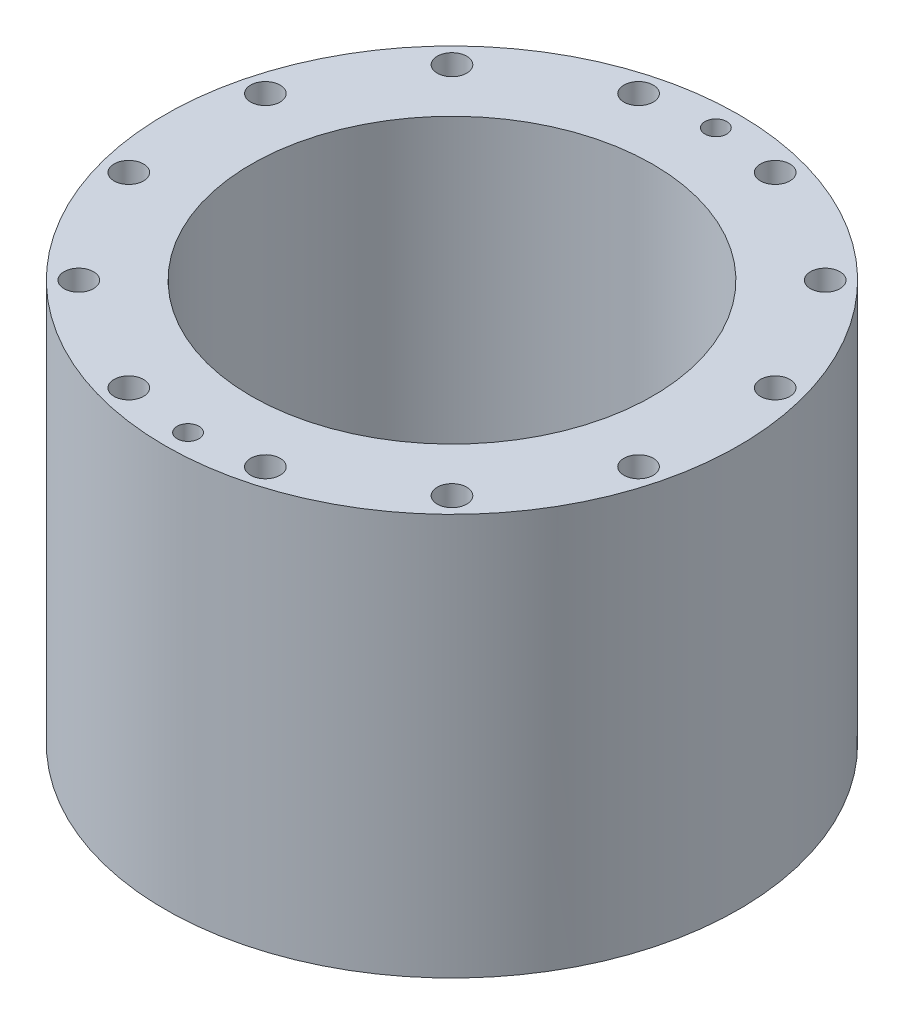
ISO-10303-21;
HEADER;
FILE_DESCRIPTION(('STEP AP214'),'2;1');
FILE_NAME('part.step','',(''),(''),'','','');
FILE_SCHEMA(('AUTOMOTIVE_DESIGN { 1 0 10303 214 1 1 1 1 }'));
ENDSEC;
DATA;
#1=APPLICATION_CONTEXT('core data for automotive mechanical design processes');
#2=APPLICATION_PROTOCOL_DEFINITION('international standard','automotive_design',2000,#1);
#3=PRODUCT_CONTEXT('',#1,'mechanical');
#4=PRODUCT('Part','Part','',(#3));
#5=PRODUCT_RELATED_PRODUCT_CATEGORY('part','',(#4));
#6=PRODUCT_DEFINITION_FORMATION('','',#4);
#7=PRODUCT_DEFINITION_CONTEXT('part definition',#1,'design');
#8=PRODUCT_DEFINITION('design','',#6,#7);
#9=PRODUCT_DEFINITION_SHAPE('','',#8);
#10=(LENGTH_UNIT() NAMED_UNIT(*) SI_UNIT(.MILLI.,.METRE.));
#11=(NAMED_UNIT(*) PLANE_ANGLE_UNIT() SI_UNIT($,.RADIAN.));
#12=(NAMED_UNIT(*) SI_UNIT($,.STERADIAN.) SOLID_ANGLE_UNIT());
#13=UNCERTAINTY_MEASURE_WITH_UNIT(LENGTH_MEASURE(1.E-05),#10,'distance_accuracy_value','');
#14=(GEOMETRIC_REPRESENTATION_CONTEXT(3) GLOBAL_UNCERTAINTY_ASSIGNED_CONTEXT((#13)) GLOBAL_UNIT_ASSIGNED_CONTEXT((#10,
#11,#12)) REPRESENTATION_CONTEXT('',''));
#15=CARTESIAN_POINT('',(0.,0.,0.));
#16=DIRECTION('',(0.,0.,1.));
#17=DIRECTION('',(1.,0.,0.));
#18=AXIS2_PLACEMENT_3D('',#15,#16,#17);
#19=CARTESIAN_POINT('',(0.,0.,0.));
#20=DIRECTION('',(0.,1.,0.));
#21=DIRECTION('',(0.,0.,1.));
#22=AXIS2_PLACEMENT_3D('',#19,#20,#21);
#23=PLANE('',#22);
#24=CARTESIAN_POINT('',(0.,0.,0.));
#25=DIRECTION('',(0.,1.,0.));
#26=DIRECTION('',(0.,0.,1.));
#27=AXIS2_PLACEMENT_3D('',#24,#25,#26);
#28=CIRCLE('',#27,44.45);
#29=CARTESIAN_POINT('',(0.,0.,44.45));
#30=VERTEX_POINT('',#29);
#31=EDGE_CURVE('E42',#30,#30,#28,.T.);
#32=ORIENTED_EDGE('',*,*,#31,.T.);
#33=EDGE_LOOP('',(#32));
#34=FACE_BOUND('',#33,.T.);
#35=CARTESIAN_POINT('',(0.,0.,0.));
#36=DIRECTION('',(0.,-1.,0.));
#37=DIRECTION('',(0.,0.,-1.));
#38=AXIS2_PLACEMENT_3D('',#35,#36,#37);
#39=CIRCLE('',#38,47.4218);
#40=CARTESIAN_POINT('',(0.,0.,-47.4218));
#41=VERTEX_POINT('',#40);
#42=EDGE_CURVE('E69',#41,#41,#39,.T.);
#43=ORIENTED_EDGE('',*,*,#42,.T.);
#44=EDGE_LOOP('',(#43));
#45=FACE_BOUND('',#44,.T.);
#46=ADVANCED_FACE('F38',(#34,#45),#23,.F.);
#47=CARTESIAN_POINT('',(0.,88.9,0.));
#48=DIRECTION('',(0.,1.,0.));
#49=DIRECTION('',(0.,0.,1.));
#50=AXIS2_PLACEMENT_3D('',#47,#48,#49);
#51=PLANE('',#50);
#52=CARTESIAN_POINT('',(0.,88.9,-58.4200000000042));
#53=DIRECTION('',(0.,1.,0.));
#54=DIRECTION('',(0.,0.,1.));
#55=AXIS2_PLACEMENT_3D('',#52,#53,#54);
#56=CIRCLE('',#55,2.413);
#57=CARTESIAN_POINT('',(0.,88.9,-56.0070000000042));
#58=VERTEX_POINT('',#57);
#59=EDGE_CURVE('E181',#58,#58,#56,.T.);
#60=ORIENTED_EDGE('',*,*,#59,.F.);
#61=EDGE_LOOP('',(#60));
#62=FACE_BOUND('',#61,.T.);
#63=CARTESIAN_POINT('',(0.,88.9,58.4200000000042));
#64=DIRECTION('',(0.,1.,0.));
#65=DIRECTION('',(0.,0.,1.));
#66=AXIS2_PLACEMENT_3D('',#63,#64,#65);
#67=CIRCLE('',#66,2.413);
#68=CARTESIAN_POINT('',(0.,88.9,60.8330000000042));
#69=VERTEX_POINT('',#68);
#70=EDGE_CURVE('E173',#69,#69,#67,.T.);
#71=ORIENTED_EDGE('',*,*,#70,.F.);
#72=EDGE_LOOP('',(#71));
#73=FACE_BOUND('',#72,.T.);
#74=CARTESIAN_POINT('',(41.30917815692,88.9,41.309178156922));
#75=DIRECTION('',(0.,-1.,0.));
#76=DIRECTION('',(0.,0.,-1.));
#77=AXIS2_PLACEMENT_3D('',#74,#75,#76);
#78=CIRCLE('',#77,3.2639);
#79=CARTESIAN_POINT('',(41.30917815692,88.9,38.045278156922));
#80=VERTEX_POINT('',#79);
#81=EDGE_CURVE('E81',#80,#80,#78,.T.);
#82=ORIENTED_EDGE('',*,*,#81,.T.);
#83=EDGE_LOOP('',(#82));
#84=FACE_BOUND('',#83,.T.);
#85=CARTESIAN_POINT('',(56.4293867718131,88.9,15.1202086148954));
#86=DIRECTION('',(0.,-1.,0.));
#87=DIRECTION('',(0.,0.,-1.));
#88=AXIS2_PLACEMENT_3D('',#85,#86,#87);
#89=CIRCLE('',#88,3.2639);
#90=CARTESIAN_POINT('',(56.4293867718131,88.9,11.8563086148954));
#91=VERTEX_POINT('',#90);
#92=EDGE_CURVE('E138',#91,#91,#89,.T.);
#93=ORIENTED_EDGE('',*,*,#92,.T.);
#94=EDGE_LOOP('',(#93));
#95=FACE_BOUND('',#94,.T.);
#96=CARTESIAN_POINT('',(56.4293867718176,88.9,-15.1202086148831));
#97=DIRECTION('',(0.,-1.,0.));
#98=DIRECTION('',(0.,0.,-1.));
#99=AXIS2_PLACEMENT_3D('',#96,#97,#98);
#100=CIRCLE('',#99,3.2639);
#101=CARTESIAN_POINT('',(56.4293867718176,88.9,-18.3841086148831));
#102=VERTEX_POINT('',#101);
#103=EDGE_CURVE('E130',#102,#102,#100,.T.);
#104=ORIENTED_EDGE('',*,*,#103,.T.);
#105=EDGE_LOOP('',(#104));
#106=FACE_BOUND('',#105,.T.);
#107=CARTESIAN_POINT('',(41.3091781569322,88.9,-41.3091781569142));
#108=DIRECTION('',(0.,-1.,0.));
#109=DIRECTION('',(0.,0.,-1.));
#110=AXIS2_PLACEMENT_3D('',#107,#108,#109);
#111=CIRCLE('',#110,3.2639);
#112=CARTESIAN_POINT('',(41.3091781569322,88.9,-44.5730781569142));
#113=VERTEX_POINT('',#112);
#114=EDGE_CURVE('E122',#113,#113,#111,.T.);
#115=ORIENTED_EDGE('',*,*,#114,.T.);
#116=EDGE_LOOP('',(#115));
#117=FACE_BOUND('',#116,.T.);
#118=CARTESIAN_POINT('',(15.1202086149056,88.9,-56.4293867718074));
#119=DIRECTION('',(0.,-1.,0.));
#120=DIRECTION('',(0.,0.,-1.));
#121=AXIS2_PLACEMENT_3D('',#118,#119,#120);
#122=CIRCLE('',#121,3.2639);
#123=CARTESIAN_POINT('',(15.1202086149056,88.9,-59.6932867718074));
#124=VERTEX_POINT('',#123);
#125=EDGE_CURVE('E114',#124,#124,#122,.T.);
#126=ORIENTED_EDGE('',*,*,#125,.T.);
#127=EDGE_LOOP('',(#126));
#128=FACE_BOUND('',#127,.T.);
#129=CARTESIAN_POINT('',(-15.120208614873,88.9,-56.4293867718118));
#130=DIRECTION('',(0.,-1.,0.));
#131=DIRECTION('',(0.,0.,-1.));
#132=AXIS2_PLACEMENT_3D('',#129,#130,#131);
#133=CIRCLE('',#132,3.2639);
#134=CARTESIAN_POINT('',(-15.120208614873,88.9,-59.6932867718118));
#135=VERTEX_POINT('',#134);
#136=EDGE_CURVE('E106',#135,#135,#133,.T.);
#137=ORIENTED_EDGE('',*,*,#136,.T.);
#138=EDGE_LOOP('',(#137));
#139=FACE_BOUND('',#138,.T.);
#140=CARTESIAN_POINT('',(-41.3091781569041,88.9,-41.3091781569264));
#141=DIRECTION('',(0.,-1.,0.));
#142=DIRECTION('',(0.,0.,-1.));
#143=AXIS2_PLACEMENT_3D('',#140,#141,#142);
#144=CIRCLE('',#143,3.2639);
#145=CARTESIAN_POINT('',(-41.3091781569041,88.9,-44.5730781569264));
#146=VERTEX_POINT('',#145);
#147=EDGE_CURVE('E98',#146,#146,#144,.T.);
#148=ORIENTED_EDGE('',*,*,#147,.T.);
#149=EDGE_LOOP('',(#148));
#150=FACE_BOUND('',#149,.T.);
#151=CARTESIAN_POINT('',(-56.4293867717972,88.9,-15.1202086148998));
#152=DIRECTION('',(0.,-1.,0.));
#153=DIRECTION('',(0.,0.,-1.));
#154=AXIS2_PLACEMENT_3D('',#151,#152,#153);
#155=CIRCLE('',#154,3.2639);
#156=CARTESIAN_POINT('',(-56.4293867717972,88.9,-18.3841086148998));
#157=VERTEX_POINT('',#156);
#158=EDGE_CURVE('E89',#157,#157,#155,.T.);
#159=ORIENTED_EDGE('',*,*,#158,.T.);
#160=EDGE_LOOP('',(#159));
#161=FACE_BOUND('',#160,.T.);
#162=CARTESIAN_POINT('',(-56.4293867718017,88.9,15.1202086148788));
#163=DIRECTION('',(0.,-1.,0.));
#164=DIRECTION('',(0.,0.,-1.));
#165=AXIS2_PLACEMENT_3D('',#162,#163,#164);
#166=CIRCLE('',#165,3.2639);
#167=CARTESIAN_POINT('',(-56.4293867718017,88.9,11.8563086148788));
#168=VERTEX_POINT('',#167);
#169=EDGE_CURVE('E90',#168,#168,#166,.T.);
#170=ORIENTED_EDGE('',*,*,#169,.T.);
#171=EDGE_LOOP('',(#170));
#172=FACE_BOUND('',#171,.T.);
#173=CARTESIAN_POINT('',(-41.3091781569163,88.9,41.3091781569098));
#174=DIRECTION('',(0.,-1.,0.));
#175=DIRECTION('',(0.,0.,-1.));
#176=AXIS2_PLACEMENT_3D('',#173,#174,#175);
#177=CIRCLE('',#176,3.2639);
#178=CARTESIAN_POINT('',(-41.3091781569163,88.9,38.0452781569098));
#179=VERTEX_POINT('',#178);
#180=EDGE_CURVE('E162',#179,#179,#177,.T.);
#181=ORIENTED_EDGE('',*,*,#180,.T.);
#182=EDGE_LOOP('',(#181));
#183=FACE_BOUND('',#182,.T.);
#184=CARTESIAN_POINT('',(-15.1202086148897,88.9,56.429386771803));
#185=DIRECTION('',(0.,-1.,0.));
#186=DIRECTION('',(0.,0.,-1.));
#187=AXIS2_PLACEMENT_3D('',#184,#185,#186);
#188=CIRCLE('',#187,3.2639);
#189=CARTESIAN_POINT('',(-15.1202086148897,88.9,53.165486771803));
#190=VERTEX_POINT('',#189);
#191=EDGE_CURVE('E153',#190,#190,#188,.T.);
#192=ORIENTED_EDGE('',*,*,#191,.T.);
#193=EDGE_LOOP('',(#192));
#194=FACE_BOUND('',#193,.T.);
#195=CARTESIAN_POINT('',(15.1202086148889,88.9,56.4293867718075));
#196=DIRECTION('',(0.,-1.,0.));
#197=DIRECTION('',(0.,0.,-1.));
#198=AXIS2_PLACEMENT_3D('',#195,#196,#197);
#199=CIRCLE('',#198,3.2639);
#200=CARTESIAN_POINT('',(15.1202086148889,88.9,53.1654867718075));
#201=VERTEX_POINT('',#200);
#202=EDGE_CURVE('E73',#201,#201,#199,.T.);
#203=ORIENTED_EDGE('',*,*,#202,.T.);
#204=EDGE_LOOP('',(#203));
#205=FACE_BOUND('',#204,.T.);
#206=CARTESIAN_POINT('',(0.,88.9,0.));
#207=DIRECTION('',(0.,1.,0.));
#208=DIRECTION('',(0.,0.,1.));
#209=AXIS2_PLACEMENT_3D('',#206,#207,#208);
#210=CIRCLE('',#209,44.45);
#211=CARTESIAN_POINT('',(0.,88.9,44.45));
#212=VERTEX_POINT('',#211);
#213=EDGE_CURVE('E10',#212,#212,#210,.T.);
#214=ORIENTED_EDGE('',*,*,#213,.F.);
#215=EDGE_LOOP('',(#214));
#216=FACE_BOUND('',#215,.T.);
#217=CARTESIAN_POINT('',(0.,88.9,0.));
#218=DIRECTION('',(0.,1.,0.));
#219=DIRECTION('',(0.,0.,1.));
#220=AXIS2_PLACEMENT_3D('',#217,#218,#219);
#221=CIRCLE('',#220,63.5);
#222=CARTESIAN_POINT('',(0.,88.9,63.5));
#223=VERTEX_POINT('',#222);
#224=EDGE_CURVE('E53',#223,#223,#221,.F.);
#225=ORIENTED_EDGE('',*,*,#224,.F.);
#226=EDGE_LOOP('',(#225));
#227=FACE_BOUND('',#226,.T.);
#228=ADVANCED_FACE('F198',(#62,#73,#84,#95,#106,#117,#128,#139,#150,#161,#172,#183,#194,#205,
#216,#227),#51,.T.);
#229=CARTESIAN_POINT('',(41.30917815692,0.,41.309178156922));
#230=DIRECTION('',(0.,-1.,0.));
#231=DIRECTION('',(0.,0.,-1.));
#232=AXIS2_PLACEMENT_3D('',#229,#230,#231);
#233=CIRCLE('',#232,3.2639);
#234=CARTESIAN_POINT('',(41.30917815692,0.,38.045278156922));
#235=VERTEX_POINT('',#234);
#236=EDGE_CURVE('E142',#235,#235,#233,.T.);
#237=ORIENTED_EDGE('',*,*,#236,.F.);
#238=EDGE_LOOP('',(#237));
#239=FACE_BOUND('',#238,.T.);
#240=CARTESIAN_POINT('',(56.4293867718131,0.,15.1202086148954));
#241=DIRECTION('',(0.,-1.,0.));
#242=DIRECTION('',(0.,0.,-1.));
#243=AXIS2_PLACEMENT_3D('',#240,#241,#242);
#244=CIRCLE('',#243,3.2639);
#245=CARTESIAN_POINT('',(56.4293867718131,0.,11.8563086148954));
#246=VERTEX_POINT('',#245);
#247=EDGE_CURVE('E134',#246,#246,#244,.T.);
#248=ORIENTED_EDGE('',*,*,#247,.F.);
#249=EDGE_LOOP('',(#248));
#250=FACE_BOUND('',#249,.T.);
#251=CARTESIAN_POINT('',(56.4293867718176,0.,-15.1202086148831));
#252=DIRECTION('',(0.,-1.,0.));
#253=DIRECTION('',(0.,0.,-1.));
#254=AXIS2_PLACEMENT_3D('',#251,#252,#253);
#255=CIRCLE('',#254,3.2639);
#256=CARTESIAN_POINT('',(56.4293867718176,0.,-18.3841086148831));
#257=VERTEX_POINT('',#256);
#258=EDGE_CURVE('E126',#257,#257,#255,.T.);
#259=ORIENTED_EDGE('',*,*,#258,.F.);
#260=EDGE_LOOP('',(#259));
#261=FACE_BOUND('',#260,.T.);
#262=CARTESIAN_POINT('',(41.3091781569322,0.,-41.3091781569142));
#263=DIRECTION('',(0.,-1.,0.));
#264=DIRECTION('',(0.,0.,-1.));
#265=AXIS2_PLACEMENT_3D('',#262,#263,#264);
#266=CIRCLE('',#265,3.2639);
#267=CARTESIAN_POINT('',(41.3091781569322,0.,-44.5730781569142));
#268=VERTEX_POINT('',#267);
#269=EDGE_CURVE('E118',#268,#268,#266,.T.);
#270=ORIENTED_EDGE('',*,*,#269,.F.);
#271=EDGE_LOOP('',(#270));
#272=FACE_BOUND('',#271,.T.);
#273=CARTESIAN_POINT('',(15.1202086149056,0.,-56.4293867718074));
#274=DIRECTION('',(0.,-1.,0.));
#275=DIRECTION('',(0.,0.,-1.));
#276=AXIS2_PLACEMENT_3D('',#273,#274,#275);
#277=CIRCLE('',#276,3.2639);
#278=CARTESIAN_POINT('',(15.1202086149056,0.,-59.6932867718074));
#279=VERTEX_POINT('',#278);
#280=EDGE_CURVE('E110',#279,#279,#277,.T.);
#281=ORIENTED_EDGE('',*,*,#280,.F.);
#282=EDGE_LOOP('',(#281));
#283=FACE_BOUND('',#282,.T.);
#284=CARTESIAN_POINT('',(-15.120208614873,0.,-56.4293867718118));
#285=DIRECTION('',(0.,-1.,0.));
#286=DIRECTION('',(0.,0.,-1.));
#287=AXIS2_PLACEMENT_3D('',#284,#285,#286);
#288=CIRCLE('',#287,3.2639);
#289=CARTESIAN_POINT('',(-15.120208614873,0.,-59.6932867718118));
#290=VERTEX_POINT('',#289);
#291=EDGE_CURVE('E102',#290,#290,#288,.T.);
#292=ORIENTED_EDGE('',*,*,#291,.F.);
#293=EDGE_LOOP('',(#292));
#294=FACE_BOUND('',#293,.T.);
#295=CARTESIAN_POINT('',(-41.3091781569041,0.,-41.3091781569264));
#296=DIRECTION('',(0.,-1.,0.));
#297=DIRECTION('',(0.,0.,-1.));
#298=AXIS2_PLACEMENT_3D('',#295,#296,#297);
#299=CIRCLE('',#298,3.2639);
#300=CARTESIAN_POINT('',(-41.3091781569041,0.,-44.5730781569264));
#301=VERTEX_POINT('',#300);
#302=EDGE_CURVE('E94',#301,#301,#299,.T.);
#303=ORIENTED_EDGE('',*,*,#302,.F.);
#304=EDGE_LOOP('',(#303));
#305=FACE_BOUND('',#304,.T.);
#306=CARTESIAN_POINT('',(-56.4293867717972,0.,-15.1202086148998));
#307=DIRECTION('',(0.,-1.,0.));
#308=DIRECTION('',(0.,0.,-1.));
#309=AXIS2_PLACEMENT_3D('',#306,#307,#308);
#310=CIRCLE('',#309,3.2639);
#311=CARTESIAN_POINT('',(-56.4293867717972,0.,-18.3841086148998));
#312=VERTEX_POINT('',#311);
#313=EDGE_CURVE('E85',#312,#312,#310,.T.);
#314=ORIENTED_EDGE('',*,*,#313,.F.);
#315=EDGE_LOOP('',(#314));
#316=FACE_BOUND('',#315,.T.);
#317=CARTESIAN_POINT('',(-56.4293867718017,0.,15.1202086148788));
#318=DIRECTION('',(0.,-1.,0.));
#319=DIRECTION('',(0.,0.,-1.));
#320=AXIS2_PLACEMENT_3D('',#317,#318,#319);
#321=CIRCLE('',#320,3.2639);
#322=CARTESIAN_POINT('',(-56.4293867718017,0.,11.8563086148788));
#323=VERTEX_POINT('',#322);
#324=EDGE_CURVE('E166',#323,#323,#321,.T.);
#325=ORIENTED_EDGE('',*,*,#324,.F.);
#326=EDGE_LOOP('',(#325));
#327=FACE_BOUND('',#326,.T.);
#328=CARTESIAN_POINT('',(-41.3091781569163,0.,41.3091781569098));
#329=DIRECTION('',(0.,-1.,0.));
#330=DIRECTION('',(0.,0.,-1.));
#331=AXIS2_PLACEMENT_3D('',#328,#329,#330);
#332=CIRCLE('',#331,3.2639);
#333=CARTESIAN_POINT('',(-41.3091781569163,0.,38.0452781569098));
#334=VERTEX_POINT('',#333);
#335=EDGE_CURVE('E158',#334,#334,#332,.T.);
#336=ORIENTED_EDGE('',*,*,#335,.F.);
#337=EDGE_LOOP('',(#336));
#338=FACE_BOUND('',#337,.T.);
#339=CARTESIAN_POINT('',(-15.1202086148897,0.,56.429386771803));
#340=DIRECTION('',(0.,-1.,0.));
#341=DIRECTION('',(0.,0.,-1.));
#342=AXIS2_PLACEMENT_3D('',#339,#340,#341);
#343=CIRCLE('',#342,3.2639);
#344=CARTESIAN_POINT('',(-15.1202086148897,0.,53.165486771803));
#345=VERTEX_POINT('',#344);
#346=EDGE_CURVE('E149',#345,#345,#343,.T.);
#347=ORIENTED_EDGE('',*,*,#346,.F.);
#348=EDGE_LOOP('',(#347));
#349=FACE_BOUND('',#348,.T.);
#350=CARTESIAN_POINT('',(15.1202086148889,0.,56.4293867718075));
#351=DIRECTION('',(0.,-1.,0.));
#352=DIRECTION('',(0.,0.,-1.));
#353=AXIS2_PLACEMENT_3D('',#350,#351,#352);
#354=CIRCLE('',#353,3.2639);
#355=CARTESIAN_POINT('',(15.1202086148889,0.,53.1654867718075));
#356=VERTEX_POINT('',#355);
#357=EDGE_CURVE('E77',#356,#356,#354,.T.);
#358=ORIENTED_EDGE('',*,*,#357,.F.);
#359=EDGE_LOOP('',(#358));
#360=FACE_BOUND('',#359,.T.);
#361=CARTESIAN_POINT('',(0.,0.,0.));
#362=DIRECTION('',(0.,-1.,0.));
#363=DIRECTION('',(0.,0.,-1.));
#364=AXIS2_PLACEMENT_3D('',#361,#362,#363);
#365=CIRCLE('',#364,50.9524);
#366=CARTESIAN_POINT('',(0.,0.,-50.9524));
#367=VERTEX_POINT('',#366);
#368=EDGE_CURVE('E61',#367,#367,#365,.T.);
#369=ORIENTED_EDGE('',*,*,#368,.F.);
#370=EDGE_LOOP('',(#369));
#371=FACE_BOUND('',#370,.T.);
#372=CARTESIAN_POINT('',(0.,0.,0.));
#373=DIRECTION('',(0.,-1.,0.));
#374=DIRECTION('',(0.,0.,-1.));
#375=AXIS2_PLACEMENT_3D('',#372,#373,#374);
#376=CIRCLE('',#375,63.5);
#377=CARTESIAN_POINT('',(0.,0.,-63.5));
#378=VERTEX_POINT('',#377);
#379=EDGE_CURVE('E51',#378,#378,#376,.T.);
#380=ORIENTED_EDGE('',*,*,#379,.T.);
#381=EDGE_LOOP('',(#380));
#382=FACE_BOUND('',#381,.T.);
#383=ADVANCED_FACE('F40',(#239,#250,#261,#272,#283,#294,#305,#316,#327,#338,#349,#360,#371,
#382),#23,.F.);
#384=CARTESIAN_POINT('',(0.,88.9,0.));
#385=DIRECTION('',(0.,-1.,0.));
#386=DIRECTION('',(0.,0.,-1.));
#387=AXIS2_PLACEMENT_3D('',#384,#385,#386);
#388=CYLINDRICAL_SURFACE('',#387,44.45);
#389=ORIENTED_EDGE('',*,*,#213,.T.);
#390=EDGE_LOOP('',(#389));
#391=FACE_BOUND('',#390,.T.);
#392=ORIENTED_EDGE('',*,*,#31,.F.);
#393=EDGE_LOOP('',(#392));
#394=FACE_BOUND('',#393,.T.);
#395=ADVANCED_FACE('F233',(#391,#394),#388,.F.);
#396=CARTESIAN_POINT('',(0.,268.505122421383,0.));
#397=DIRECTION('',(0.,-1.,0.));
#398=DIRECTION('',(0.,0.,-1.));
#399=AXIS2_PLACEMENT_3D('',#396,#397,#398);
#400=CYLINDRICAL_SURFACE('',#399,63.5);
#401=ORIENTED_EDGE('',*,*,#379,.F.);
#402=EDGE_LOOP('',(#401));
#403=FACE_BOUND('',#402,.T.);
#404=ORIENTED_EDGE('',*,*,#224,.T.);
#405=EDGE_LOOP('',(#404));
#406=FACE_BOUND('',#405,.T.);
#407=ADVANCED_FACE('F230',(#403,#406),#400,.T.);
#408=CARTESIAN_POINT('',(0.,1.9812,0.));
#409=DIRECTION('',(0.,-1.,0.));
#410=DIRECTION('',(0.,0.,-1.));
#411=AXIS2_PLACEMENT_3D('',#408,#409,#410);
#412=CYLINDRICAL_SURFACE('',#411,50.9524);
#413=CARTESIAN_POINT('',(0.,1.9812,0.));
#414=DIRECTION('',(0.,-1.,0.));
#415=DIRECTION('',(0.,0.,-1.));
#416=AXIS2_PLACEMENT_3D('',#413,#414,#415);
#417=CIRCLE('',#416,50.9524);
#418=CARTESIAN_POINT('',(0.,1.9812,-50.9524));
#419=VERTEX_POINT('',#418);
#420=EDGE_CURVE('E57',#419,#419,#417,.T.);
#421=ORIENTED_EDGE('',*,*,#420,.F.);
#422=EDGE_LOOP('',(#421));
#423=FACE_BOUND('',#422,.T.);
#424=ORIENTED_EDGE('',*,*,#368,.T.);
#425=EDGE_LOOP('',(#424));
#426=FACE_BOUND('',#425,.T.);
#427=ADVANCED_FACE('F232',(#423,#426),#412,.F.);
#428=CARTESIAN_POINT('',(0.,1.9812,0.));
#429=DIRECTION('',(0.,-1.,0.));
#430=DIRECTION('',(0.,0.,-1.));
#431=AXIS2_PLACEMENT_3D('',#428,#429,#430);
#432=PLANE('',#431);
#433=CARTESIAN_POINT('',(0.,1.9812,0.));
#434=DIRECTION('',(0.,-1.,0.));
#435=DIRECTION('',(0.,0.,-1.));
#436=AXIS2_PLACEMENT_3D('',#433,#434,#435);
#437=CIRCLE('',#436,47.4218);
#438=CARTESIAN_POINT('',(0.,1.9812,-47.4218));
#439=VERTEX_POINT('',#438);
#440=EDGE_CURVE('E65',#439,#439,#437,.T.);
#441=ORIENTED_EDGE('',*,*,#440,.F.);
#442=EDGE_LOOP('',(#441));
#443=FACE_BOUND('',#442,.T.);
#444=ORIENTED_EDGE('',*,*,#420,.T.);
#445=EDGE_LOOP('',(#444));
#446=FACE_BOUND('',#445,.T.);
#447=ADVANCED_FACE('F240',(#443,#446),#432,.T.);
#448=CARTESIAN_POINT('',(0.,1.9812,0.));
#449=DIRECTION('',(0.,-1.,0.));
#450=DIRECTION('',(0.,0.,-1.));
#451=AXIS2_PLACEMENT_3D('',#448,#449,#450);
#452=CYLINDRICAL_SURFACE('',#451,47.4218);
#453=ORIENTED_EDGE('',*,*,#440,.T.);
#454=EDGE_LOOP('',(#453));
#455=FACE_BOUND('',#454,.T.);
#456=ORIENTED_EDGE('',*,*,#42,.F.);
#457=EDGE_LOOP('',(#456));
#458=FACE_BOUND('',#457,.T.);
#459=ADVANCED_FACE('F286',(#455,#458),#452,.T.);
#460=CARTESIAN_POINT('',(15.1202086148889,88.9,56.4293867718075));
#461=DIRECTION('',(0.,-1.,0.));
#462=DIRECTION('',(0.,0.,-1.));
#463=AXIS2_PLACEMENT_3D('',#460,#461,#462);
#464=CYLINDRICAL_SURFACE('',#463,3.2639);
#465=ORIENTED_EDGE('',*,*,#202,.F.);
#466=EDGE_LOOP('',(#465));
#467=FACE_BOUND('',#466,.T.);
#468=ORIENTED_EDGE('',*,*,#357,.T.);
#469=EDGE_LOOP('',(#468));
#470=FACE_BOUND('',#469,.T.);
#471=ADVANCED_FACE('F283',(#467,#470),#464,.F.);
#472=CARTESIAN_POINT('',(-15.1202086148897,88.9,56.429386771803));
#473=DIRECTION('',(0.,-1.,0.));
#474=DIRECTION('',(0.,0.,-1.));
#475=AXIS2_PLACEMENT_3D('',#472,#473,#474);
#476=CYLINDRICAL_SURFACE('',#475,3.2639);
#477=ORIENTED_EDGE('',*,*,#191,.F.);
#478=EDGE_LOOP('',(#477));
#479=FACE_BOUND('',#478,.T.);
#480=ORIENTED_EDGE('',*,*,#346,.T.);
#481=EDGE_LOOP('',(#480));
#482=FACE_BOUND('',#481,.T.);
#483=ADVANCED_FACE('F285',(#479,#482),#476,.F.);
#484=CARTESIAN_POINT('',(-41.3091781569163,88.9,41.3091781569098));
#485=DIRECTION('',(0.,-1.,0.));
#486=DIRECTION('',(0.,0.,-1.));
#487=AXIS2_PLACEMENT_3D('',#484,#485,#486);
#488=CYLINDRICAL_SURFACE('',#487,3.2639);
#489=ORIENTED_EDGE('',*,*,#180,.F.);
#490=EDGE_LOOP('',(#489));
#491=FACE_BOUND('',#490,.T.);
#492=ORIENTED_EDGE('',*,*,#335,.T.);
#493=EDGE_LOOP('',(#492));
#494=FACE_BOUND('',#493,.T.);
#495=ADVANCED_FACE('F293',(#491,#494),#488,.F.);
#496=CARTESIAN_POINT('',(-56.4293867718017,88.9,15.1202086148788));
#497=DIRECTION('',(0.,-1.,0.));
#498=DIRECTION('',(0.,0.,-1.));
#499=AXIS2_PLACEMENT_3D('',#496,#497,#498);
#500=CYLINDRICAL_SURFACE('',#499,3.2639);
#501=ORIENTED_EDGE('',*,*,#169,.F.);
#502=EDGE_LOOP('',(#501));
#503=FACE_BOUND('',#502,.T.);
#504=ORIENTED_EDGE('',*,*,#324,.T.);
#505=EDGE_LOOP('',(#504));
#506=FACE_BOUND('',#505,.T.);
#507=ADVANCED_FACE('F343',(#503,#506),#500,.F.);
#508=CARTESIAN_POINT('',(-56.4293867717972,88.9,-15.1202086148998));
#509=DIRECTION('',(0.,-1.,0.));
#510=DIRECTION('',(0.,0.,-1.));
#511=AXIS2_PLACEMENT_3D('',#508,#509,#510);
#512=CYLINDRICAL_SURFACE('',#511,3.2639);
#513=ORIENTED_EDGE('',*,*,#158,.F.);
#514=EDGE_LOOP('',(#513));
#515=FACE_BOUND('',#514,.T.);
#516=ORIENTED_EDGE('',*,*,#313,.T.);
#517=EDGE_LOOP('',(#516));
#518=FACE_BOUND('',#517,.T.);
#519=ADVANCED_FACE('F299',(#515,#518),#512,.F.);
#520=CARTESIAN_POINT('',(-41.3091781569041,88.9,-41.3091781569264));
#521=DIRECTION('',(0.,-1.,0.));
#522=DIRECTION('',(0.,0.,-1.));
#523=AXIS2_PLACEMENT_3D('',#520,#521,#522);
#524=CYLINDRICAL_SURFACE('',#523,3.2639);
#525=ORIENTED_EDGE('',*,*,#147,.F.);
#526=EDGE_LOOP('',(#525));
#527=FACE_BOUND('',#526,.T.);
#528=ORIENTED_EDGE('',*,*,#302,.T.);
#529=EDGE_LOOP('',(#528));
#530=FACE_BOUND('',#529,.T.);
#531=ADVANCED_FACE('F362',(#527,#530),#524,.F.);
#532=CARTESIAN_POINT('',(-15.120208614873,88.9,-56.4293867718118));
#533=DIRECTION('',(0.,-1.,0.));
#534=DIRECTION('',(0.,0.,-1.));
#535=AXIS2_PLACEMENT_3D('',#532,#533,#534);
#536=CYLINDRICAL_SURFACE('',#535,3.2639);
#537=ORIENTED_EDGE('',*,*,#136,.F.);
#538=EDGE_LOOP('',(#537));
#539=FACE_BOUND('',#538,.T.);
#540=ORIENTED_EDGE('',*,*,#291,.T.);
#541=EDGE_LOOP('',(#540));
#542=FACE_BOUND('',#541,.T.);
#543=ADVANCED_FACE('F371',(#539,#542),#536,.F.);
#544=CARTESIAN_POINT('',(15.1202086149056,88.9,-56.4293867718074));
#545=DIRECTION('',(0.,-1.,0.));
#546=DIRECTION('',(0.,0.,-1.));
#547=AXIS2_PLACEMENT_3D('',#544,#545,#546);
#548=CYLINDRICAL_SURFACE('',#547,3.2639);
#549=ORIENTED_EDGE('',*,*,#125,.F.);
#550=EDGE_LOOP('',(#549));
#551=FACE_BOUND('',#550,.T.);
#552=ORIENTED_EDGE('',*,*,#280,.T.);
#553=EDGE_LOOP('',(#552));
#554=FACE_BOUND('',#553,.T.);
#555=ADVANCED_FACE('F380',(#551,#554),#548,.F.);
#556=CARTESIAN_POINT('',(41.3091781569322,88.9,-41.3091781569142));
#557=DIRECTION('',(0.,-1.,0.));
#558=DIRECTION('',(0.,0.,-1.));
#559=AXIS2_PLACEMENT_3D('',#556,#557,#558);
#560=CYLINDRICAL_SURFACE('',#559,3.2639);
#561=ORIENTED_EDGE('',*,*,#114,.F.);
#562=EDGE_LOOP('',(#561));
#563=FACE_BOUND('',#562,.T.);
#564=ORIENTED_EDGE('',*,*,#269,.T.);
#565=EDGE_LOOP('',(#564));
#566=FACE_BOUND('',#565,.T.);
#567=ADVANCED_FACE('F390',(#563,#566),#560,.F.);
#568=CARTESIAN_POINT('',(56.4293867718176,88.9,-15.1202086148831));
#569=DIRECTION('',(0.,-1.,0.));
#570=DIRECTION('',(0.,0.,-1.));
#571=AXIS2_PLACEMENT_3D('',#568,#569,#570);
#572=CYLINDRICAL_SURFACE('',#571,3.2639);
#573=ORIENTED_EDGE('',*,*,#103,.F.);
#574=EDGE_LOOP('',(#573));
#575=FACE_BOUND('',#574,.T.);
#576=ORIENTED_EDGE('',*,*,#258,.T.);
#577=EDGE_LOOP('',(#576));
#578=FACE_BOUND('',#577,.T.);
#579=ADVANCED_FACE('F400',(#575,#578),#572,.F.);
#580=CARTESIAN_POINT('',(56.4293867718131,88.9,15.1202086148954));
#581=DIRECTION('',(0.,-1.,0.));
#582=DIRECTION('',(0.,0.,-1.));
#583=AXIS2_PLACEMENT_3D('',#580,#581,#582);
#584=CYLINDRICAL_SURFACE('',#583,3.2639);
#585=ORIENTED_EDGE('',*,*,#92,.F.);
#586=EDGE_LOOP('',(#585));
#587=FACE_BOUND('',#586,.T.);
#588=ORIENTED_EDGE('',*,*,#247,.T.);
#589=EDGE_LOOP('',(#588));
#590=FACE_BOUND('',#589,.T.);
#591=ADVANCED_FACE('F410',(#587,#590),#584,.F.);
#592=CARTESIAN_POINT('',(41.30917815692,88.9,41.309178156922));
#593=DIRECTION('',(0.,-1.,0.));
#594=DIRECTION('',(0.,0.,-1.));
#595=AXIS2_PLACEMENT_3D('',#592,#593,#594);
#596=CYLINDRICAL_SURFACE('',#595,3.2639);
#597=ORIENTED_EDGE('',*,*,#81,.F.);
#598=EDGE_LOOP('',(#597));
#599=FACE_BOUND('',#598,.T.);
#600=ORIENTED_EDGE('',*,*,#236,.T.);
#601=EDGE_LOOP('',(#600));
#602=FACE_BOUND('',#601,.T.);
#603=ADVANCED_FACE('F420',(#599,#602),#596,.F.);
#604=CARTESIAN_POINT('',(0.,84.074,58.4200000000042));
#605=DIRECTION('',(0.,1.,0.));
#606=DIRECTION('',(0.,0.,1.));
#607=AXIS2_PLACEMENT_3D('',#604,#605,#606);
#608=CYLINDRICAL_SURFACE('',#607,2.413);
#609=CARTESIAN_POINT('',(0.,84.074,58.4200000000042));
#610=DIRECTION('',(0.,1.,0.));
#611=DIRECTION('',(0.,0.,1.));
#612=AXIS2_PLACEMENT_3D('',#609,#610,#611);
#613=CIRCLE('',#612,2.413);
#614=CARTESIAN_POINT('',(0.,84.074,60.8330000000042));
#615=VERTEX_POINT('',#614);
#616=EDGE_CURVE('E177',#615,#615,#613,.T.);
#617=ORIENTED_EDGE('',*,*,#616,.F.);
#618=EDGE_LOOP('',(#617));
#619=FACE_BOUND('',#618,.T.);
#620=ORIENTED_EDGE('',*,*,#70,.T.);
#621=EDGE_LOOP('',(#620));
#622=FACE_BOUND('',#621,.T.);
#623=ADVANCED_FACE('F429',(#619,#622),#608,.F.);
#624=CARTESIAN_POINT('',(0.,84.074,58.4200000000042));
#625=DIRECTION('',(0.,1.,0.));
#626=DIRECTION('',(0.,0.,1.));
#627=AXIS2_PLACEMENT_3D('',#624,#625,#626);
#628=PLANE('',#627);
#629=ORIENTED_EDGE('',*,*,#616,.T.);
#630=EDGE_LOOP('',(#629));
#631=FACE_BOUND('',#630,.T.);
#632=ADVANCED_FACE('F194',(#631),#628,.T.);
#633=CARTESIAN_POINT('',(0.,84.074,-58.4200000000042));
#634=DIRECTION('',(0.,1.,0.));
#635=DIRECTION('',(0.,0.,1.));
#636=AXIS2_PLACEMENT_3D('',#633,#634,#635);
#637=CYLINDRICAL_SURFACE('',#636,2.413);
#638=CARTESIAN_POINT('',(0.,84.074,-58.4200000000042));
#639=DIRECTION('',(0.,1.,0.));
#640=DIRECTION('',(0.,0.,1.));
#641=AXIS2_PLACEMENT_3D('',#638,#639,#640);
#642=CIRCLE('',#641,2.413);
#643=CARTESIAN_POINT('',(0.,84.074,-56.0070000000042));
#644=VERTEX_POINT('',#643);
#645=EDGE_CURVE('E154',#644,#644,#642,.T.);
#646=ORIENTED_EDGE('',*,*,#645,.F.);
#647=EDGE_LOOP('',(#646));
#648=FACE_BOUND('',#647,.T.);
#649=ORIENTED_EDGE('',*,*,#59,.T.);
#650=EDGE_LOOP('',(#649));
#651=FACE_BOUND('',#650,.T.);
#652=ADVANCED_FACE('F191',(#648,#651),#637,.F.);
#653=CARTESIAN_POINT('',(0.,84.074,-58.4200000000042));
#654=DIRECTION('',(0.,1.,0.));
#655=DIRECTION('',(0.,0.,1.));
#656=AXIS2_PLACEMENT_3D('',#653,#654,#655);
#657=PLANE('',#656);
#658=ORIENTED_EDGE('',*,*,#645,.T.);
#659=EDGE_LOOP('',(#658));
#660=FACE_BOUND('',#659,.T.);
#661=ADVANCED_FACE('F189',(#660),#657,.T.);
#662=CLOSED_SHELL('',(#46,#228,#383,#395,#407,#427,#447,#459,#471,#483,#495,#507,#519,#531,#543,
#555,#567,#579,#591,#603,#623,#632,#652,#661));
#663=MANIFOLD_SOLID_BREP('B2',#662);
#664=ADVANCED_BREP_SHAPE_REPRESENTATION('',(#18,#663),#14);
#665=SHAPE_DEFINITION_REPRESENTATION(#9,#664);
ENDSEC;
END-ISO-10303-21;
